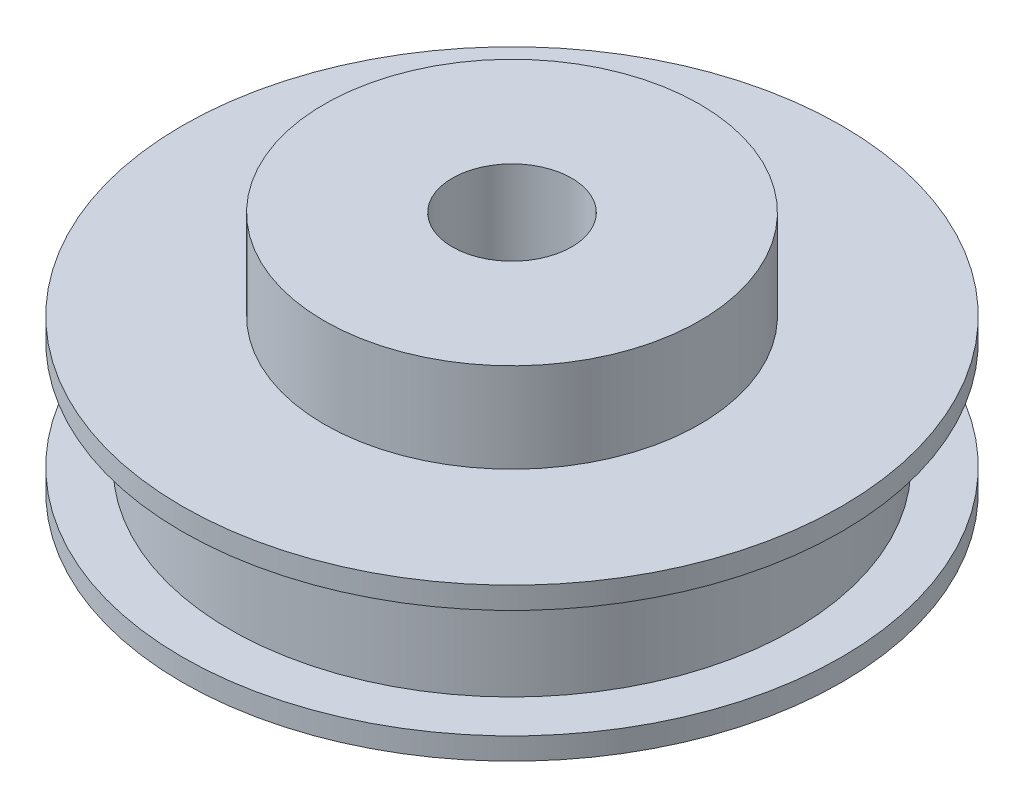
ISO-10303-21;
HEADER;
FILE_DESCRIPTION(('STEP AP214'),'2;1');
FILE_NAME('part.step','',(''),(''),'','','');
FILE_SCHEMA(('AUTOMOTIVE_DESIGN { 1 0 10303 214 1 1 1 1 }'));
ENDSEC;
DATA;
#1=APPLICATION_CONTEXT('core data for automotive mechanical design processes');
#2=APPLICATION_PROTOCOL_DEFINITION('international standard','automotive_design',2000,#1);
#3=PRODUCT_CONTEXT('',#1,'mechanical');
#4=PRODUCT('Part','Part','',(#3));
#5=PRODUCT_RELATED_PRODUCT_CATEGORY('part','',(#4));
#6=PRODUCT_DEFINITION_FORMATION('','',#4);
#7=PRODUCT_DEFINITION_CONTEXT('part definition',#1,'design');
#8=PRODUCT_DEFINITION('design','',#6,#7);
#9=PRODUCT_DEFINITION_SHAPE('','',#8);
#10=(LENGTH_UNIT() NAMED_UNIT(*) SI_UNIT(.MILLI.,.METRE.));
#11=(NAMED_UNIT(*) PLANE_ANGLE_UNIT() SI_UNIT($,.RADIAN.));
#12=(NAMED_UNIT(*) SI_UNIT($,.STERADIAN.) SOLID_ANGLE_UNIT());
#13=UNCERTAINTY_MEASURE_WITH_UNIT(LENGTH_MEASURE(1.E-05),#10,'distance_accuracy_value','');
#14=(GEOMETRIC_REPRESENTATION_CONTEXT(3) GLOBAL_UNCERTAINTY_ASSIGNED_CONTEXT((#13)) GLOBAL_UNIT_ASSIGNED_CONTEXT((#10,
#11,#12)) REPRESENTATION_CONTEXT('',''));
#15=CARTESIAN_POINT('',(0.,0.,0.));
#16=DIRECTION('',(0.,0.,1.));
#17=DIRECTION('',(1.,0.,0.));
#18=AXIS2_PLACEMENT_3D('',#15,#16,#17);
#19=CARTESIAN_POINT('',(0.,10.16,0.));
#20=DIRECTION('',(0.,-1.,0.));
#21=DIRECTION('',(0.,0.,-1.));
#22=AXIS2_PLACEMENT_3D('',#19,#20,#21);
#23=CYLINDRICAL_SURFACE('',#22,21.971);
#24=CARTESIAN_POINT('',(0.,10.16,0.));
#25=DIRECTION('',(0.,1.,0.));
#26=DIRECTION('',(0.,0.,1.));
#27=AXIS2_PLACEMENT_3D('',#24,#25,#26);
#28=CIRCLE('',#27,21.971);
#29=CARTESIAN_POINT('',(0.,10.16,21.971));
#30=VERTEX_POINT('',#29);
#31=EDGE_CURVE('E46',#30,#30,#28,.T.);
#32=ORIENTED_EDGE('',*,*,#31,.F.);
#33=EDGE_LOOP('',(#32));
#34=FACE_BOUND('',#33,.T.);
#35=CARTESIAN_POINT('',(0.,8.6995,0.));
#36=DIRECTION('',(0.,-1.,0.));
#37=DIRECTION('',(0.,0.,-1.));
#38=AXIS2_PLACEMENT_3D('',#35,#36,#37);
#39=CIRCLE('',#38,21.971);
#40=CARTESIAN_POINT('',(0.,8.6995,-21.971));
#41=VERTEX_POINT('',#40);
#42=EDGE_CURVE('E64',#41,#41,#39,.T.);
#43=ORIENTED_EDGE('',*,*,#42,.F.);
#44=EDGE_LOOP('',(#43));
#45=FACE_BOUND('',#44,.T.);
#46=ADVANCED_FACE('F39',(#34,#45),#23,.T.);
#47=CARTESIAN_POINT('',(0.,10.16,0.));
#48=DIRECTION('',(0.,1.,0.));
#49=DIRECTION('',(0.,0.,1.));
#50=AXIS2_PLACEMENT_3D('',#47,#48,#49);
#51=PLANE('',#50);
#52=CARTESIAN_POINT('',(0.,10.16,0.));
#53=DIRECTION('',(0.,1.,0.));
#54=DIRECTION('',(0.,0.,1.));
#55=AXIS2_PLACEMENT_3D('',#52,#53,#54);
#56=CIRCLE('',#55,12.5095);
#57=CARTESIAN_POINT('',(0.,10.16,12.5095));
#58=VERTEX_POINT('',#57);
#59=EDGE_CURVE('E10',#58,#58,#56,.T.);
#60=ORIENTED_EDGE('',*,*,#59,.F.);
#61=EDGE_LOOP('',(#60));
#62=FACE_BOUND('',#61,.T.);
#63=ORIENTED_EDGE('',*,*,#31,.T.);
#64=EDGE_LOOP('',(#63));
#65=FACE_BOUND('',#64,.T.);
#66=ADVANCED_FACE('F89',(#62,#65),#51,.T.);
#67=CARTESIAN_POINT('',(-18.796,8.6995,0.));
#68=DIRECTION('',(0.,-1.,0.));
#69=DIRECTION('',(0.,0.,-1.));
#70=AXIS2_PLACEMENT_3D('',#67,#68,#69);
#71=PLANE('',#70);
#72=ORIENTED_EDGE('',*,*,#42,.T.);
#73=EDGE_LOOP('',(#72));
#74=FACE_BOUND('',#73,.T.);
#75=CARTESIAN_POINT('',(0.,8.6995,0.));
#76=DIRECTION('',(0.,-1.,0.));
#77=DIRECTION('',(0.,0.,-1.));
#78=AXIS2_PLACEMENT_3D('',#75,#76,#77);
#79=CIRCLE('',#78,18.796);
#80=CARTESIAN_POINT('',(0.,8.6995,-18.796));
#81=VERTEX_POINT('',#80);
#82=EDGE_CURVE('E55',#81,#81,#79,.T.);
#83=ORIENTED_EDGE('',*,*,#82,.F.);
#84=EDGE_LOOP('',(#83));
#85=FACE_BOUND('',#84,.T.);
#86=ADVANCED_FACE('F94',(#74,#85),#71,.T.);
#87=CARTESIAN_POINT('',(-21.971,1.4605,0.));
#88=DIRECTION('',(0.,1.,0.));
#89=DIRECTION('',(0.,0.,1.));
#90=AXIS2_PLACEMENT_3D('',#87,#88,#89);
#91=PLANE('',#90);
#92=CARTESIAN_POINT('',(0.,1.4605,0.));
#93=DIRECTION('',(0.,-1.,0.));
#94=DIRECTION('',(0.,0.,-1.));
#95=AXIS2_PLACEMENT_3D('',#92,#93,#94);
#96=CIRCLE('',#95,18.796);
#97=CARTESIAN_POINT('',(0.,1.4605,-18.796));
#98=VERTEX_POINT('',#97);
#99=EDGE_CURVE('E58',#98,#98,#96,.T.);
#100=ORIENTED_EDGE('',*,*,#99,.T.);
#101=EDGE_LOOP('',(#100));
#102=FACE_BOUND('',#101,.T.);
#103=CARTESIAN_POINT('',(0.,1.4605,0.));
#104=DIRECTION('',(0.,-1.,0.));
#105=DIRECTION('',(0.,0.,-1.));
#106=AXIS2_PLACEMENT_3D('',#103,#104,#105);
#107=CIRCLE('',#106,21.971);
#108=CARTESIAN_POINT('',(0.,1.4605,-21.971));
#109=VERTEX_POINT('',#108);
#110=EDGE_CURVE('E61',#109,#109,#107,.T.);
#111=ORIENTED_EDGE('',*,*,#110,.F.);
#112=EDGE_LOOP('',(#111));
#113=FACE_BOUND('',#112,.T.);
#114=ADVANCED_FACE('F83',(#102,#113),#91,.T.);
#115=CARTESIAN_POINT('',(0.,0.,0.));
#116=DIRECTION('',(0.,-1.,0.));
#117=DIRECTION('',(0.,0.,-1.));
#118=AXIS2_PLACEMENT_3D('',#115,#116,#117);
#119=CYLINDRICAL_SURFACE('',#118,18.796);
#120=ORIENTED_EDGE('',*,*,#82,.T.);
#121=EDGE_LOOP('',(#120));
#122=FACE_BOUND('',#121,.T.);
#123=ORIENTED_EDGE('',*,*,#99,.F.);
#124=EDGE_LOOP('',(#123));
#125=FACE_BOUND('',#124,.T.);
#126=ADVANCED_FACE('F76',(#122,#125),#119,.T.);
#127=CARTESIAN_POINT('',(0.,0.,0.));
#128=DIRECTION('',(0.,1.,0.));
#129=DIRECTION('',(0.,0.,1.));
#130=AXIS2_PLACEMENT_3D('',#127,#128,#129);
#131=PLANE('',#130);
#132=CARTESIAN_POINT('',(0.,0.,0.));
#133=DIRECTION('',(0.,1.,0.));
#134=DIRECTION('',(0.,0.,1.));
#135=AXIS2_PLACEMENT_3D('',#132,#133,#134);
#136=CIRCLE('',#135,3.9751);
#137=CARTESIAN_POINT('',(0.,0.,3.9751));
#138=VERTEX_POINT('',#137);
#139=EDGE_CURVE('E121',#138,#138,#136,.T.);
#140=ORIENTED_EDGE('',*,*,#139,.T.);
#141=EDGE_LOOP('',(#140));
#142=FACE_BOUND('',#141,.T.);
#143=CARTESIAN_POINT('',(0.,0.,0.));
#144=DIRECTION('',(0.,1.,0.));
#145=DIRECTION('',(0.,0.,1.));
#146=AXIS2_PLACEMENT_3D('',#143,#144,#145);
#147=CIRCLE('',#146,21.971);
#148=CARTESIAN_POINT('',(0.,0.,21.971));
#149=VERTEX_POINT('',#148);
#150=EDGE_CURVE('E42',#149,#149,#147,.T.);
#151=ORIENTED_EDGE('',*,*,#150,.F.);
#152=EDGE_LOOP('',(#151));
#153=FACE_BOUND('',#152,.T.);
#154=ADVANCED_FACE('F74',(#142,#153),#131,.F.);
#155=ORIENTED_EDGE('',*,*,#150,.T.);
#156=EDGE_LOOP('',(#155));
#157=FACE_BOUND('',#156,.T.);
#158=ORIENTED_EDGE('',*,*,#110,.T.);
#159=EDGE_LOOP('',(#158));
#160=FACE_BOUND('',#159,.T.);
#161=ADVANCED_FACE('F71',(#157,#160),#23,.T.);
#162=CARTESIAN_POINT('',(0.,16.129,0.));
#163=DIRECTION('',(0.,-1.,0.));
#164=DIRECTION('',(0.,0.,-1.));
#165=AXIS2_PLACEMENT_3D('',#162,#163,#164);
#166=CYLINDRICAL_SURFACE('',#165,12.5095);
#167=CARTESIAN_POINT('',(0.,16.129,0.));
#168=DIRECTION('',(0.,1.,0.));
#169=DIRECTION('',(0.,0.,1.));
#170=AXIS2_PLACEMENT_3D('',#167,#168,#169);
#171=CIRCLE('',#170,12.5095);
#172=CARTESIAN_POINT('',(0.,16.129,12.5095));
#173=VERTEX_POINT('',#172);
#174=EDGE_CURVE('E53',#173,#173,#171,.T.);
#175=ORIENTED_EDGE('',*,*,#174,.F.);
#176=EDGE_LOOP('',(#175));
#177=FACE_BOUND('',#176,.T.);
#178=ORIENTED_EDGE('',*,*,#59,.T.);
#179=EDGE_LOOP('',(#178));
#180=FACE_BOUND('',#179,.T.);
#181=ADVANCED_FACE('F82',(#177,#180),#166,.T.);
#182=CARTESIAN_POINT('',(0.,16.129,0.));
#183=DIRECTION('',(0.,1.,0.));
#184=DIRECTION('',(0.,0.,1.));
#185=AXIS2_PLACEMENT_3D('',#182,#183,#184);
#186=PLANE('',#185);
#187=CARTESIAN_POINT('',(0.,16.129,0.));
#188=DIRECTION('',(0.,1.,0.));
#189=DIRECTION('',(0.,0.,1.));
#190=AXIS2_PLACEMENT_3D('',#187,#188,#189);
#191=CIRCLE('',#190,3.9751);
#192=CARTESIAN_POINT('',(0.,16.129,3.9751));
#193=VERTEX_POINT('',#192);
#194=EDGE_CURVE('E124',#193,#193,#191,.T.);
#195=ORIENTED_EDGE('',*,*,#194,.F.);
#196=EDGE_LOOP('',(#195));
#197=FACE_BOUND('',#196,.T.);
#198=ORIENTED_EDGE('',*,*,#174,.T.);
#199=EDGE_LOOP('',(#198));
#200=FACE_BOUND('',#199,.T.);
#201=ADVANCED_FACE('F109',(#197,#200),#186,.T.);
#202=CARTESIAN_POINT('',(0.,0.,0.));
#203=DIRECTION('',(0.,1.,0.));
#204=DIRECTION('',(0.,0.,1.));
#205=AXIS2_PLACEMENT_3D('',#202,#203,#204);
#206=CYLINDRICAL_SURFACE('',#205,3.9751);
#207=ORIENTED_EDGE('',*,*,#139,.F.);
#208=EDGE_LOOP('',(#207));
#209=FACE_BOUND('',#208,.T.);
#210=ORIENTED_EDGE('',*,*,#194,.T.);
#211=EDGE_LOOP('',(#210));
#212=FACE_BOUND('',#211,.T.);
#213=ADVANCED_FACE('F113',(#209,#212),#206,.F.);
#214=CLOSED_SHELL('',(#46,#66,#86,#114,#126,#154,#161,#181,#201,#213));
#215=MANIFOLD_SOLID_BREP('B2',#214);
#216=ADVANCED_BREP_SHAPE_REPRESENTATION('',(#18,#215),#14);
#217=SHAPE_DEFINITION_REPRESENTATION(#9,#216);
ENDSEC;
END-ISO-10303-21;
